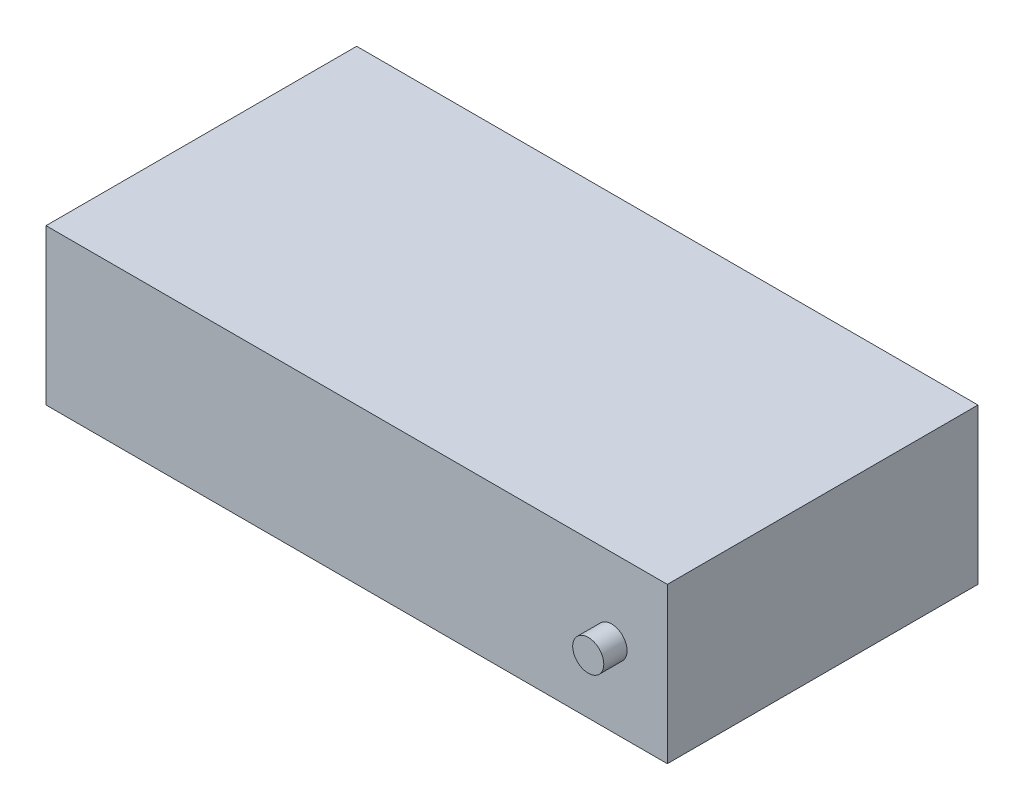
ISO-10303-21;
HEADER;
FILE_DESCRIPTION(('STEP AP214'),'2;1');
FILE_NAME('part.step','',(''),(''),'','','');
FILE_SCHEMA(('AUTOMOTIVE_DESIGN { 1 0 10303 214 1 1 1 1 }'));
ENDSEC;
DATA;
#1=APPLICATION_CONTEXT('core data for automotive mechanical design processes');
#2=APPLICATION_PROTOCOL_DEFINITION('international standard','automotive_design',2000,#1);
#3=PRODUCT_CONTEXT('',#1,'mechanical');
#4=PRODUCT('Part','Part','',(#3));
#5=PRODUCT_RELATED_PRODUCT_CATEGORY('part','',(#4));
#6=PRODUCT_DEFINITION_FORMATION('','',#4);
#7=PRODUCT_DEFINITION_CONTEXT('part definition',#1,'design');
#8=PRODUCT_DEFINITION('design','',#6,#7);
#9=PRODUCT_DEFINITION_SHAPE('','',#8);
#10=(LENGTH_UNIT() NAMED_UNIT(*) SI_UNIT(.MILLI.,.METRE.));
#11=(NAMED_UNIT(*) PLANE_ANGLE_UNIT() SI_UNIT($,.RADIAN.));
#12=(NAMED_UNIT(*) SI_UNIT($,.STERADIAN.) SOLID_ANGLE_UNIT());
#13=UNCERTAINTY_MEASURE_WITH_UNIT(LENGTH_MEASURE(1.E-05),#10,'distance_accuracy_value','');
#14=(GEOMETRIC_REPRESENTATION_CONTEXT(3) GLOBAL_UNCERTAINTY_ASSIGNED_CONTEXT((#13)) GLOBAL_UNIT_ASSIGNED_CONTEXT((#10,
#11,#12)) REPRESENTATION_CONTEXT('',''));
#15=CARTESIAN_POINT('',(0.,0.,0.));
#16=DIRECTION('',(0.,0.,1.));
#17=DIRECTION('',(1.,0.,0.));
#18=AXIS2_PLACEMENT_3D('',#15,#16,#17);
#19=CARTESIAN_POINT('',(40.,20.,-20.));
#20=DIRECTION('',(-1.,0.,0.));
#21=DIRECTION('',(0.,0.,1.));
#22=AXIS2_PLACEMENT_3D('',#19,#20,#21);
#23=PLANE('',#22);
#24=DIRECTION('',(0.,0.,-1.));
#25=VECTOR('',#24,1.);
#26=CARTESIAN_POINT('',(40.,0.,-20.));
#27=LINE('',#26,#25);
#28=CARTESIAN_POINT('',(40.,0.,20.));
#29=VERTEX_POINT('',#28);
#30=CARTESIAN_POINT('',(40.,0.,-20.));
#31=VERTEX_POINT('',#30);
#32=EDGE_CURVE('E108',#29,#31,#27,.T.);
#33=ORIENTED_EDGE('',*,*,#32,.T.);
#34=DIRECTION('',(0.,-1.,0.));
#35=VECTOR('',#34,1.);
#36=CARTESIAN_POINT('',(40.,20.,-20.));
#37=LINE('',#36,#35);
#38=CARTESIAN_POINT('',(40.,20.,-20.));
#39=VERTEX_POINT('',#38);
#40=EDGE_CURVE('E12',#39,#31,#37,.T.);
#41=ORIENTED_EDGE('',*,*,#40,.F.);
#42=DIRECTION('',(0.,0.,-1.));
#43=VECTOR('',#42,1.);
#44=CARTESIAN_POINT('',(40.,20.,-20.));
#45=LINE('',#44,#43);
#46=CARTESIAN_POINT('',(40.,20.,20.));
#47=VERTEX_POINT('',#46);
#48=EDGE_CURVE('E92',#47,#39,#45,.T.);
#49=ORIENTED_EDGE('',*,*,#48,.F.);
#50=DIRECTION('',(0.,-1.,0.));
#51=VECTOR('',#50,1.);
#52=CARTESIAN_POINT('',(40.,20.,20.));
#53=LINE('',#52,#51);
#54=EDGE_CURVE('E104',#47,#29,#53,.T.);
#55=ORIENTED_EDGE('',*,*,#54,.T.);
#56=EDGE_LOOP('',(#33,#41,#49,#55));
#57=FACE_BOUND('',#56,.T.);
#58=ADVANCED_FACE('F40',(#57),#23,.F.);
#59=CARTESIAN_POINT('',(-40.,20.,-20.));
#60=DIRECTION('',(0.,0.,1.));
#61=DIRECTION('',(1.,0.,0.));
#62=AXIS2_PLACEMENT_3D('',#59,#60,#61);
#63=PLANE('',#62);
#64=CARTESIAN_POINT('',(32.8174063502027,10.,-20.));
#65=DIRECTION('',(0.,0.,1.));
#66=DIRECTION('',(1.,0.,0.));
#67=AXIS2_PLACEMENT_3D('',#64,#65,#66);
#68=CIRCLE('',#67,2.);
#69=CARTESIAN_POINT('',(34.8174063502027,10.,-20.));
#70=VERTEX_POINT('',#69);
#71=EDGE_CURVE('E132',#70,#70,#68,.F.);
#72=ORIENTED_EDGE('',*,*,#71,.F.);
#73=EDGE_LOOP('',(#72));
#74=FACE_BOUND('',#73,.T.);
#75=DIRECTION('',(-1.,0.,0.));
#76=VECTOR('',#75,1.);
#77=CARTESIAN_POINT('',(-40.,0.,-20.));
#78=LINE('',#77,#76);
#79=CARTESIAN_POINT('',(-40.,0.,-20.));
#80=VERTEX_POINT('',#79);
#81=EDGE_CURVE('E97',#31,#80,#78,.T.);
#82=ORIENTED_EDGE('',*,*,#81,.T.);
#83=DIRECTION('',(0.,-1.,0.));
#84=VECTOR('',#83,1.);
#85=CARTESIAN_POINT('',(-40.,20.,-20.));
#86=LINE('',#85,#84);
#87=CARTESIAN_POINT('',(-40.,20.,-20.));
#88=VERTEX_POINT('',#87);
#89=EDGE_CURVE('E49',#88,#80,#86,.T.);
#90=ORIENTED_EDGE('',*,*,#89,.F.);
#91=DIRECTION('',(-1.,0.,0.));
#92=VECTOR('',#91,1.);
#93=CARTESIAN_POINT('',(-40.,20.,-20.));
#94=LINE('',#93,#92);
#95=EDGE_CURVE('E87',#39,#88,#94,.T.);
#96=ORIENTED_EDGE('',*,*,#95,.F.);
#97=ORIENTED_EDGE('',*,*,#40,.T.);
#98=EDGE_LOOP('',(#82,#90,#96,#97));
#99=FACE_BOUND('',#98,.T.);
#100=ADVANCED_FACE('F96',(#74,#99),#63,.F.);
#101=CARTESIAN_POINT('',(-40.,20.,-20.));
#102=DIRECTION('',(1.,0.,0.));
#103=DIRECTION('',(0.,0.,-1.));
#104=AXIS2_PLACEMENT_3D('',#101,#102,#103);
#105=PLANE('',#104);
#106=DIRECTION('',(0.,0.,1.));
#107=VECTOR('',#106,1.);
#108=CARTESIAN_POINT('',(-40.,0.,-20.));
#109=LINE('',#108,#107);
#110=CARTESIAN_POINT('',(-40.,0.,20.));
#111=VERTEX_POINT('',#110);
#112=EDGE_CURVE('E74',#80,#111,#109,.T.);
#113=ORIENTED_EDGE('',*,*,#112,.T.);
#114=DIRECTION('',(0.,-1.,0.));
#115=VECTOR('',#114,1.);
#116=CARTESIAN_POINT('',(-40.,20.,20.));
#117=LINE('',#116,#115);
#118=CARTESIAN_POINT('',(-40.,20.,20.));
#119=VERTEX_POINT('',#118);
#120=EDGE_CURVE('E99',#119,#111,#117,.T.);
#121=ORIENTED_EDGE('',*,*,#120,.F.);
#122=DIRECTION('',(0.,0.,1.));
#123=VECTOR('',#122,1.);
#124=CARTESIAN_POINT('',(-40.,20.,-20.));
#125=LINE('',#124,#123);
#126=EDGE_CURVE('E90',#88,#119,#125,.T.);
#127=ORIENTED_EDGE('',*,*,#126,.F.);
#128=ORIENTED_EDGE('',*,*,#89,.T.);
#129=EDGE_LOOP('',(#113,#121,#127,#128));
#130=FACE_BOUND('',#129,.T.);
#131=ADVANCED_FACE('F100',(#130),#105,.F.);
#132=CARTESIAN_POINT('',(-40.,20.,20.));
#133=DIRECTION('',(0.,0.,-1.));
#134=DIRECTION('',(-1.,0.,0.));
#135=AXIS2_PLACEMENT_3D('',#132,#133,#134);
#136=PLANE('',#135);
#137=CARTESIAN_POINT('',(32.8174063502027,10.,20.));
#138=DIRECTION('',(0.,0.,1.));
#139=DIRECTION('',(1.,0.,0.));
#140=AXIS2_PLACEMENT_3D('',#137,#138,#139);
#141=CIRCLE('',#140,2.);
#142=CARTESIAN_POINT('',(34.8174063502027,10.,20.));
#143=VERTEX_POINT('',#142);
#144=EDGE_CURVE('E112',#143,#143,#141,.T.);
#145=ORIENTED_EDGE('',*,*,#144,.F.);
#146=EDGE_LOOP('',(#145));
#147=FACE_BOUND('',#146,.T.);
#148=DIRECTION('',(1.,0.,0.));
#149=VECTOR('',#148,1.);
#150=CARTESIAN_POINT('',(-40.,0.,20.));
#151=LINE('',#150,#149);
#152=EDGE_CURVE('E80',#111,#29,#151,.T.);
#153=ORIENTED_EDGE('',*,*,#152,.T.);
#154=ORIENTED_EDGE('',*,*,#54,.F.);
#155=DIRECTION('',(1.,0.,0.));
#156=VECTOR('',#155,1.);
#157=CARTESIAN_POINT('',(-40.,20.,20.));
#158=LINE('',#157,#156);
#159=EDGE_CURVE('E57',#119,#47,#158,.T.);
#160=ORIENTED_EDGE('',*,*,#159,.F.);
#161=ORIENTED_EDGE('',*,*,#120,.T.);
#162=EDGE_LOOP('',(#153,#154,#160,#161));
#163=FACE_BOUND('',#162,.T.);
#164=ADVANCED_FACE('F122',(#147,#163),#136,.F.);
#165=CARTESIAN_POINT('',(0.,20.,0.));
#166=DIRECTION('',(0.,1.,0.));
#167=DIRECTION('',(0.,0.,1.));
#168=AXIS2_PLACEMENT_3D('',#165,#166,#167);
#169=PLANE('',#168);
#170=ORIENTED_EDGE('',*,*,#48,.T.);
#171=ORIENTED_EDGE('',*,*,#95,.T.);
#172=ORIENTED_EDGE('',*,*,#126,.T.);
#173=ORIENTED_EDGE('',*,*,#159,.T.);
#174=EDGE_LOOP('',(#170,#171,#172,#173));
#175=FACE_BOUND('',#174,.T.);
#176=ADVANCED_FACE('F88',(#175),#169,.T.);
#177=CARTESIAN_POINT('',(0.,0.,0.));
#178=DIRECTION('',(0.,1.,0.));
#179=DIRECTION('',(0.,0.,1.));
#180=AXIS2_PLACEMENT_3D('',#177,#178,#179);
#181=PLANE('',#180);
#182=ORIENTED_EDGE('',*,*,#32,.F.);
#183=ORIENTED_EDGE('',*,*,#152,.F.);
#184=ORIENTED_EDGE('',*,*,#112,.F.);
#185=ORIENTED_EDGE('',*,*,#81,.F.);
#186=EDGE_LOOP('',(#182,#183,#184,#185));
#187=FACE_BOUND('',#186,.T.);
#188=ADVANCED_FACE('F125',(#187),#181,.F.);
#189=CARTESIAN_POINT('',(0.,0.,23.));
#190=DIRECTION('',(0.,0.,1.));
#191=DIRECTION('',(1.,0.,0.));
#192=AXIS2_PLACEMENT_3D('',#189,#190,#191);
#193=PLANE('',#192);
#194=CARTESIAN_POINT('',(32.8174063502027,10.,23.));
#195=DIRECTION('',(0.,0.,1.));
#196=DIRECTION('',(1.,0.,0.));
#197=AXIS2_PLACEMENT_3D('',#194,#195,#196);
#198=CIRCLE('',#197,2.);
#199=CARTESIAN_POINT('',(34.8174063502027,10.,23.));
#200=VERTEX_POINT('',#199);
#201=EDGE_CURVE('E140',#200,#200,#198,.T.);
#202=ORIENTED_EDGE('',*,*,#201,.T.);
#203=EDGE_LOOP('',(#202));
#204=FACE_BOUND('',#203,.T.);
#205=ADVANCED_FACE('F145',(#204),#193,.T.);
#206=CARTESIAN_POINT('',(32.8174063502027,10.,0.));
#207=DIRECTION('',(0.,0.,-1.));
#208=DIRECTION('',(-1.,0.,0.));
#209=AXIS2_PLACEMENT_3D('',#206,#207,#208);
#210=CYLINDRICAL_SURFACE('',#209,2.);
#211=ORIENTED_EDGE('',*,*,#201,.F.);
#212=EDGE_LOOP('',(#211));
#213=FACE_BOUND('',#212,.T.);
#214=ORIENTED_EDGE('',*,*,#144,.T.);
#215=EDGE_LOOP('',(#214));
#216=FACE_BOUND('',#215,.T.);
#217=ADVANCED_FACE('F147',(#213,#216),#210,.T.);
#218=CARTESIAN_POINT('',(32.8174063502027,10.,-23.));
#219=DIRECTION('',(0.,0.,1.));
#220=DIRECTION('',(1.,0.,0.));
#221=AXIS2_PLACEMENT_3D('',#218,#219,#220);
#222=CIRCLE('',#221,2.);
#223=CARTESIAN_POINT('',(34.8174063502027,10.,-23.));
#224=VERTEX_POINT('',#223);
#225=EDGE_CURVE('E136',#224,#224,#222,.T.);
#226=ORIENTED_EDGE('',*,*,#225,.T.);
#227=EDGE_LOOP('',(#226));
#228=FACE_BOUND('',#227,.T.);
#229=ORIENTED_EDGE('',*,*,#71,.T.);
#230=EDGE_LOOP('',(#229));
#231=FACE_BOUND('',#230,.T.);
#232=ADVANCED_FACE('F150',(#228,#231),#210,.T.);
#233=CARTESIAN_POINT('',(0.,0.,-23.));
#234=DIRECTION('',(0.,0.,1.));
#235=DIRECTION('',(1.,0.,0.));
#236=AXIS2_PLACEMENT_3D('',#233,#234,#235);
#237=PLANE('',#236);
#238=ORIENTED_EDGE('',*,*,#225,.F.);
#239=EDGE_LOOP('',(#238));
#240=FACE_BOUND('',#239,.T.);
#241=ADVANCED_FACE('F173',(#240),#237,.F.);
#242=CLOSED_SHELL('',(#58,#100,#131,#164,#176,#188,#205,#217,#232,#241));
#243=MANIFOLD_SOLID_BREP('B2',#242);
#244=ADVANCED_BREP_SHAPE_REPRESENTATION('',(#18,#243),#14);
#245=SHAPE_DEFINITION_REPRESENTATION(#9,#244);
ENDSEC;
END-ISO-10303-21;
